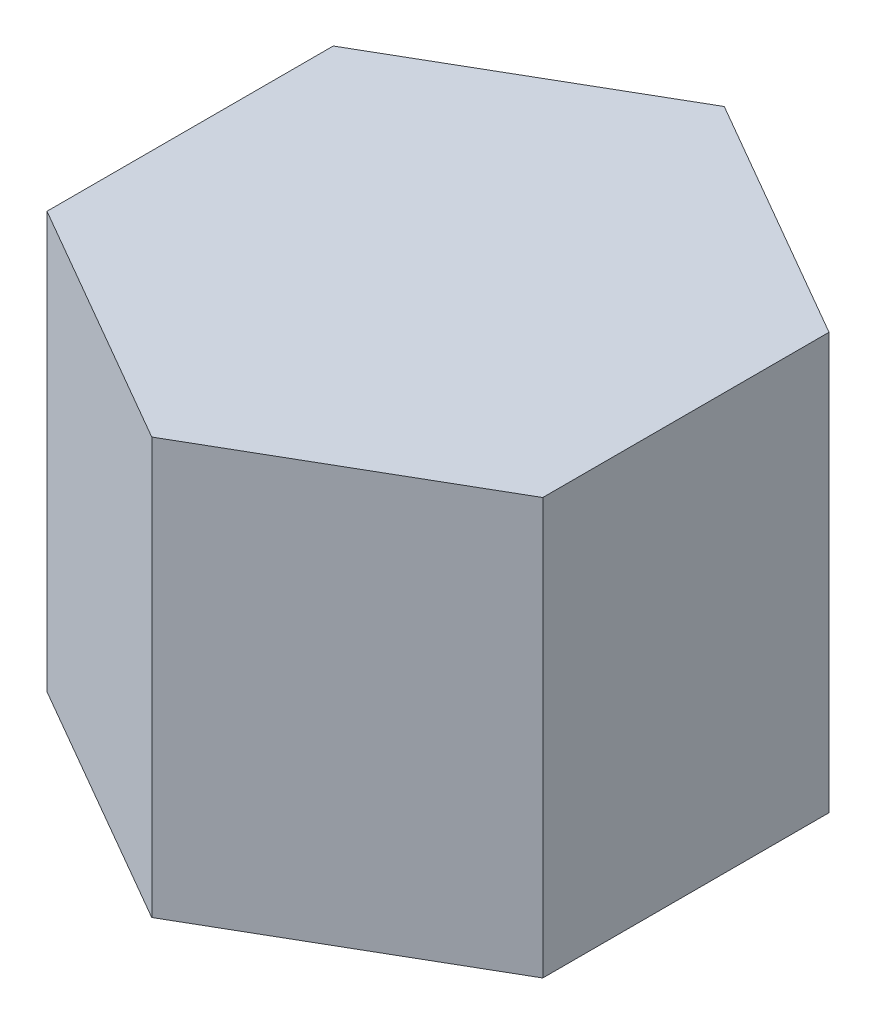
ISO-10303-21;
HEADER;
FILE_DESCRIPTION(('STEP AP214'),'2;1');
FILE_NAME('part.step','',(''),(''),'','','');
FILE_SCHEMA(('AUTOMOTIVE_DESIGN { 1 0 10303 214 1 1 1 1 }'));
ENDSEC;
DATA;
#1=APPLICATION_CONTEXT('core data for automotive mechanical design processes');
#2=APPLICATION_PROTOCOL_DEFINITION('international standard','automotive_design',2000,#1);
#3=PRODUCT_CONTEXT('',#1,'mechanical');
#4=PRODUCT('Part','Part','',(#3));
#5=PRODUCT_RELATED_PRODUCT_CATEGORY('part','',(#4));
#6=PRODUCT_DEFINITION_FORMATION('','',#4);
#7=PRODUCT_DEFINITION_CONTEXT('part definition',#1,'design');
#8=PRODUCT_DEFINITION('design','',#6,#7);
#9=PRODUCT_DEFINITION_SHAPE('','',#8);
#10=(LENGTH_UNIT() NAMED_UNIT(*) SI_UNIT(.MILLI.,.METRE.));
#11=(NAMED_UNIT(*) PLANE_ANGLE_UNIT() SI_UNIT($,.RADIAN.));
#12=(NAMED_UNIT(*) SI_UNIT($,.STERADIAN.) SOLID_ANGLE_UNIT());
#13=UNCERTAINTY_MEASURE_WITH_UNIT(LENGTH_MEASURE(1.E-05),#10,'distance_accuracy_value','');
#14=(GEOMETRIC_REPRESENTATION_CONTEXT(3) GLOBAL_UNCERTAINTY_ASSIGNED_CONTEXT((#13)) GLOBAL_UNIT_ASSIGNED_CONTEXT((#10,
#11,#12)) REPRESENTATION_CONTEXT('',''));
#15=CARTESIAN_POINT('',(0.,0.,0.));
#16=DIRECTION('',(0.,0.,1.));
#17=DIRECTION('',(1.,0.,0.));
#18=AXIS2_PLACEMENT_3D('',#15,#16,#17);
#19=CARTESIAN_POINT('',(203.339551417382,-147.556598747966,291.681971220494));
#20=DIRECTION('',(-0.500000000000096,0.,-0.866025403784383));
#21=DIRECTION('',(-0.866025403784383,0.,0.500000000000096));
#22=AXIS2_PLACEMENT_3D('',#19,#20,#21);
#23=PLANE('',#22);
#24=CARTESIAN_POINT('',(203.642660308706,-147.047793579175,291.506971220494));
#25=DIRECTION('',(-0.866025403784383,0.,0.500000000000096));
#26=VECTOR('',#25,1.);
#27=LINE('',#24,#26);
#28=CARTESIAN_POINT('',(203.642660308706,-147.047793579175,291.506971220494));
#29=VERTEX_POINT('',#28);
#30=CARTESIAN_POINT('',(203.339551417382,-147.047793579175,291.681971220494));
#31=VERTEX_POINT('',#30);
#32=EDGE_CURVE('E170',#29,#31,#27,.T.);
#33=ORIENTED_EDGE('',*,*,#32,.T.);
#34=CARTESIAN_POINT('',(203.339551417382,-147.556598747966,291.681971220494));
#35=DIRECTION('',(0.,1.,0.));
#36=VECTOR('',#35,1.);
#37=LINE('',#34,#36);
#38=CARTESIAN_POINT('',(203.339551417382,-147.556598747966,291.681971220494));
#39=VERTEX_POINT('',#38);
#40=EDGE_CURVE('E35',#39,#31,#37,.T.);
#41=ORIENTED_EDGE('',*,*,#40,.F.);
#42=CARTESIAN_POINT('',(203.642660308706,-147.556598747966,291.506971220494));
#43=DIRECTION('',(-0.866025403784383,0.,0.500000000000096));
#44=VECTOR('',#43,1.);
#45=LINE('',#42,#44);
#46=CARTESIAN_POINT('',(203.642660308706,-147.556598747966,291.506971220494));
#47=VERTEX_POINT('',#46);
#48=EDGE_CURVE('E159',#47,#39,#45,.T.);
#49=ORIENTED_EDGE('',*,*,#48,.F.);
#50=CARTESIAN_POINT('',(203.642660308706,-147.556598747966,291.506971220494));
#51=DIRECTION('',(0.,1.,0.));
#52=VECTOR('',#51,1.);
#53=LINE('',#50,#52);
#54=EDGE_CURVE('E10',#47,#29,#53,.T.);
#55=ORIENTED_EDGE('',*,*,#54,.T.);
#56=EDGE_LOOP('',(#33,#41,#49,#55));
#57=FACE_BOUND('',#56,.T.);
#58=ADVANCED_FACE('F16',(#57),#23,.F.);
#59=CARTESIAN_POINT('',(203.642660308706,-147.556598747966,291.594471220494));
#60=DIRECTION('',(-1.,0.,0.));
#61=DIRECTION('',(0.,-1.,0.));
#62=AXIS2_PLACEMENT_3D('',#59,#60,#61);
#63=PLANE('',#62);
#64=CARTESIAN_POINT('',(203.642660308706,-147.047793579175,291.156971220494));
#65=DIRECTION('',(0.,0.,1.));
#66=VECTOR('',#65,1.);
#67=LINE('',#64,#66);
#68=CARTESIAN_POINT('',(203.642660308706,-147.047793579175,291.156971220494));
#69=VERTEX_POINT('',#68);
#70=EDGE_CURVE('E167',#69,#29,#67,.T.);
#71=ORIENTED_EDGE('',*,*,#70,.T.);
#72=ORIENTED_EDGE('',*,*,#54,.F.);
#73=CARTESIAN_POINT('',(203.642660308706,-147.556598747966,291.156971220494));
#74=DIRECTION('',(0.,0.,1.));
#75=VECTOR('',#74,1.);
#76=LINE('',#73,#75);
#77=CARTESIAN_POINT('',(203.642660308706,-147.556598747966,291.156971220494));
#78=VERTEX_POINT('',#77);
#79=EDGE_CURVE('E156',#78,#47,#76,.T.);
#80=ORIENTED_EDGE('',*,*,#79,.F.);
#81=CARTESIAN_POINT('',(203.642660308706,-147.556598747966,291.156971220494));
#82=DIRECTION('',(0.,1.,0.));
#83=VECTOR('',#82,1.);
#84=LINE('',#81,#83);
#85=EDGE_CURVE('E27',#78,#69,#84,.T.);
#86=ORIENTED_EDGE('',*,*,#85,.T.);
#87=EDGE_LOOP('',(#71,#72,#80,#86));
#88=FACE_BOUND('',#87,.T.);
#89=ADVANCED_FACE('F189',(#88),#63,.F.);
#90=CARTESIAN_POINT('',(203.642660308706,-147.556598747966,291.156971220494));
#91=DIRECTION('',(-0.499999999999943,0.,0.866025403784471));
#92=DIRECTION('',(0.866025403784471,0.,0.499999999999943));
#93=AXIS2_PLACEMENT_3D('',#90,#91,#92);
#94=PLANE('',#93);
#95=CARTESIAN_POINT('',(203.339551417381,-147.047793579175,290.981971220494));
#96=DIRECTION('',(0.866025403784471,0.,0.499999999999943));
#97=VECTOR('',#96,1.);
#98=LINE('',#95,#97);
#99=CARTESIAN_POINT('',(203.339551417382,-147.047793579175,290.981971220494));
#100=VERTEX_POINT('',#99);
#101=EDGE_CURVE('E163',#100,#69,#98,.T.);
#102=ORIENTED_EDGE('',*,*,#101,.T.);
#103=ORIENTED_EDGE('',*,*,#85,.F.);
#104=CARTESIAN_POINT('',(203.339551417381,-147.556598747966,290.981971220494));
#105=DIRECTION('',(0.866025403784471,0.,0.499999999999943));
#106=VECTOR('',#105,1.);
#107=LINE('',#104,#106);
#108=CARTESIAN_POINT('',(203.339551417382,-147.556598747966,290.981971220494));
#109=VERTEX_POINT('',#108);
#110=EDGE_CURVE('E106',#109,#78,#107,.T.);
#111=ORIENTED_EDGE('',*,*,#110,.F.);
#112=CARTESIAN_POINT('',(203.339551417381,-147.556598747966,290.981971220494));
#113=DIRECTION('',(0.,1.,0.));
#114=VECTOR('',#113,1.);
#115=LINE('',#112,#114);
#116=EDGE_CURVE('E94',#109,#100,#115,.T.);
#117=ORIENTED_EDGE('',*,*,#116,.T.);
#118=EDGE_LOOP('',(#102,#103,#111,#117));
#119=FACE_BOUND('',#118,.T.);
#120=ADVANCED_FACE('F198',(#119),#94,.F.);
#121=CARTESIAN_POINT('',(203.339551417382,-147.556598747966,290.981971220494));
#122=DIRECTION('',(0.500000000000096,0.,0.866025403784383));
#123=DIRECTION('',(0.866025403784383,0.,-0.500000000000096));
#124=AXIS2_PLACEMENT_3D('',#121,#122,#123);
#125=PLANE('',#124);
#126=CARTESIAN_POINT('',(203.036442526057,-147.047793579175,291.156971220494));
#127=DIRECTION('',(0.866025403784383,0.,-0.500000000000096));
#128=VECTOR('',#127,1.);
#129=LINE('',#126,#128);
#130=CARTESIAN_POINT('',(203.036442526057,-147.047793579175,291.156971220494));
#131=VERTEX_POINT('',#130);
#132=EDGE_CURVE('E162',#131,#100,#129,.T.);
#133=ORIENTED_EDGE('',*,*,#132,.T.);
#134=ORIENTED_EDGE('',*,*,#116,.F.);
#135=CARTESIAN_POINT('',(203.036442526057,-147.556598747966,291.156971220494));
#136=DIRECTION('',(0.866025403784383,0.,-0.500000000000096));
#137=VECTOR('',#136,1.);
#138=LINE('',#135,#137);
#139=CARTESIAN_POINT('',(203.036442526057,-147.556598747966,291.156971220494));
#140=VERTEX_POINT('',#139);
#141=EDGE_CURVE('E98',#140,#109,#138,.T.);
#142=ORIENTED_EDGE('',*,*,#141,.F.);
#143=CARTESIAN_POINT('',(203.036442526057,-147.556598747966,291.156971220494));
#144=DIRECTION('',(0.,1.,0.));
#145=VECTOR('',#144,1.);
#146=LINE('',#143,#145);
#147=EDGE_CURVE('E79',#140,#131,#146,.T.);
#148=ORIENTED_EDGE('',*,*,#147,.T.);
#149=EDGE_LOOP('',(#133,#134,#142,#148));
#150=FACE_BOUND('',#149,.T.);
#151=ADVANCED_FACE('F100',(#150),#125,.F.);
#152=CARTESIAN_POINT('',(203.036442526057,-147.556598747966,291.594471220494));
#153=DIRECTION('',(1.,0.,0.));
#154=DIRECTION('',(0.,1.,0.));
#155=AXIS2_PLACEMENT_3D('',#152,#153,#154);
#156=PLANE('',#155);
#157=CARTESIAN_POINT('',(203.036442526057,-147.047793579175,291.506971220494));
#158=DIRECTION('',(0.,0.,-1.));
#159=VECTOR('',#158,1.);
#160=LINE('',#157,#159);
#161=CARTESIAN_POINT('',(203.036442526057,-147.047793579175,291.506971220494));
#162=VERTEX_POINT('',#161);
#163=EDGE_CURVE('E88',#162,#131,#160,.T.);
#164=ORIENTED_EDGE('',*,*,#163,.T.);
#165=ORIENTED_EDGE('',*,*,#147,.F.);
#166=CARTESIAN_POINT('',(203.036442526057,-147.556598747966,291.506971220494));
#167=DIRECTION('',(0.,0.,-1.));
#168=VECTOR('',#167,1.);
#169=LINE('',#166,#168);
#170=CARTESIAN_POINT('',(203.036442526057,-147.556598747966,291.506971220494));
#171=VERTEX_POINT('',#170);
#172=EDGE_CURVE('E84',#171,#140,#169,.T.);
#173=ORIENTED_EDGE('',*,*,#172,.F.);
#174=CARTESIAN_POINT('',(203.036442526057,-147.556598747966,291.506971220494));
#175=DIRECTION('',(0.,1.,0.));
#176=VECTOR('',#175,1.);
#177=LINE('',#174,#176);
#178=EDGE_CURVE('E58',#171,#162,#177,.T.);
#179=ORIENTED_EDGE('',*,*,#178,.T.);
#180=EDGE_LOOP('',(#164,#165,#173,#179));
#181=FACE_BOUND('',#180,.T.);
#182=ADVANCED_FACE('F82',(#181),#156,.F.);
#183=CARTESIAN_POINT('',(203.036442526057,-147.556598747966,291.506971220494));
#184=DIRECTION('',(0.500000000000062,0.,-0.866025403784403));
#185=DIRECTION('',(-0.866025403784403,0.,-0.500000000000062));
#186=AXIS2_PLACEMENT_3D('',#183,#184,#185);
#187=PLANE('',#186);
#188=CARTESIAN_POINT('',(203.339551417382,-147.047793579175,291.681971220494));
#189=DIRECTION('',(-0.866025403784403,0.,-0.500000000000062));
#190=VECTOR('',#189,1.);
#191=LINE('',#188,#190);
#192=EDGE_CURVE('E160',#31,#162,#191,.T.);
#193=ORIENTED_EDGE('',*,*,#192,.T.);
#194=ORIENTED_EDGE('',*,*,#178,.F.);
#195=CARTESIAN_POINT('',(203.339551417382,-147.556598747966,291.681971220494));
#196=DIRECTION('',(-0.866025403784403,0.,-0.500000000000062));
#197=VECTOR('',#196,1.);
#198=LINE('',#195,#197);
#199=EDGE_CURVE('E112',#39,#171,#198,.T.);
#200=ORIENTED_EDGE('',*,*,#199,.F.);
#201=ORIENTED_EDGE('',*,*,#40,.T.);
#202=EDGE_LOOP('',(#193,#194,#200,#201));
#203=FACE_BOUND('',#202,.T.);
#204=ADVANCED_FACE('F131',(#203),#187,.F.);
#205=CARTESIAN_POINT('',(206.491105863044,-147.556598747966,291.594471220494));
#206=DIRECTION('',(0.,1.,0.));
#207=DIRECTION('',(-1.,0.,0.));
#208=AXIS2_PLACEMENT_3D('',#205,#206,#207);
#209=PLANE('',#208);
#210=ORIENTED_EDGE('',*,*,#48,.T.);
#211=ORIENTED_EDGE('',*,*,#199,.T.);
#212=ORIENTED_EDGE('',*,*,#172,.T.);
#213=ORIENTED_EDGE('',*,*,#141,.T.);
#214=ORIENTED_EDGE('',*,*,#110,.T.);
#215=ORIENTED_EDGE('',*,*,#79,.T.);
#216=EDGE_LOOP('',(#210,#211,#212,#213,#214,#215));
#217=FACE_BOUND('',#216,.T.);
#218=ADVANCED_FACE('F111',(#217),#209,.F.);
#219=CARTESIAN_POINT('',(206.491105863044,-147.047793579175,291.594471220494));
#220=DIRECTION('',(0.,1.,0.));
#221=DIRECTION('',(-1.,0.,0.));
#222=AXIS2_PLACEMENT_3D('',#219,#220,#221);
#223=PLANE('',#222);
#224=ORIENTED_EDGE('',*,*,#32,.F.);
#225=ORIENTED_EDGE('',*,*,#70,.F.);
#226=ORIENTED_EDGE('',*,*,#101,.F.);
#227=ORIENTED_EDGE('',*,*,#132,.F.);
#228=ORIENTED_EDGE('',*,*,#163,.F.);
#229=ORIENTED_EDGE('',*,*,#192,.F.);
#230=EDGE_LOOP('',(#224,#225,#226,#227,#228,#229));
#231=FACE_BOUND('',#230,.T.);
#232=ADVANCED_FACE('F130',(#231),#223,.T.);
#233=CLOSED_SHELL('',(#58,#89,#120,#151,#182,#204,#218,#232));
#234=MANIFOLD_SOLID_BREP('B1',#233);
#235=ADVANCED_BREP_SHAPE_REPRESENTATION('',(#18,#234),#14);
#236=SHAPE_DEFINITION_REPRESENTATION(#9,#235);
ENDSEC;
END-ISO-10303-21;
